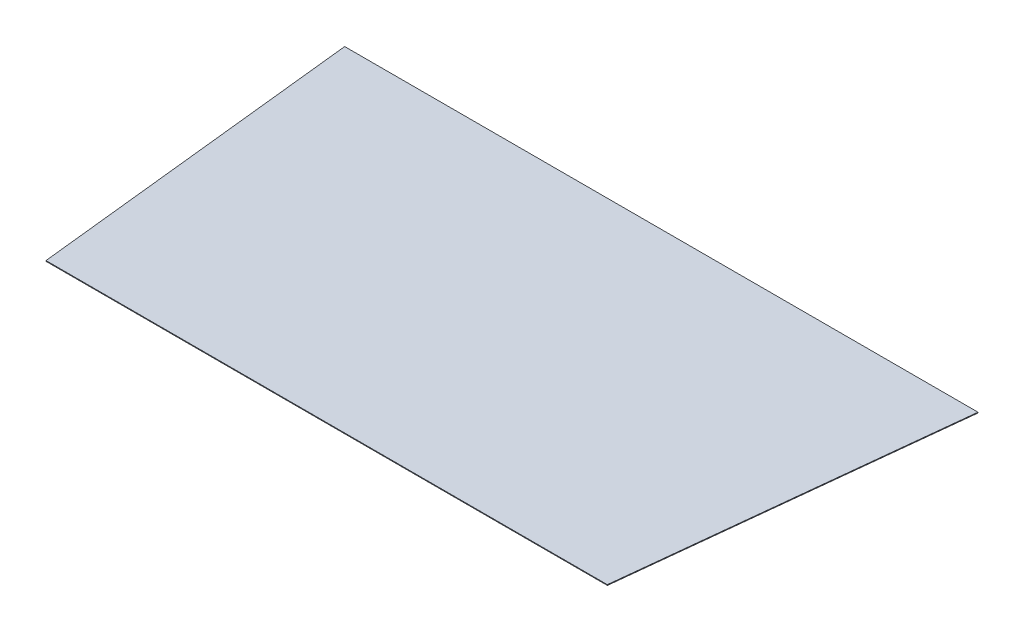
ISO-10303-21;
HEADER;
FILE_DESCRIPTION(('STEP AP214'),'2;1');
FILE_NAME('part.step','',(''),(''),'','','');
FILE_SCHEMA(('AUTOMOTIVE_DESIGN { 1 0 10303 214 1 1 1 1 }'));
ENDSEC;
DATA;
#1=APPLICATION_CONTEXT('core data for automotive mechanical design processes');
#2=APPLICATION_PROTOCOL_DEFINITION('international standard','automotive_design',2000,#1);
#3=PRODUCT_CONTEXT('',#1,'mechanical');
#4=PRODUCT('Part','Part','',(#3));
#5=PRODUCT_RELATED_PRODUCT_CATEGORY('part','',(#4));
#6=PRODUCT_DEFINITION_FORMATION('','',#4);
#7=PRODUCT_DEFINITION_CONTEXT('part definition',#1,'design');
#8=PRODUCT_DEFINITION('design','',#6,#7);
#9=PRODUCT_DEFINITION_SHAPE('','',#8);
#10=(LENGTH_UNIT() NAMED_UNIT(*) SI_UNIT(.MILLI.,.METRE.));
#11=(NAMED_UNIT(*) PLANE_ANGLE_UNIT() SI_UNIT($,.RADIAN.));
#12=(NAMED_UNIT(*) SI_UNIT($,.STERADIAN.) SOLID_ANGLE_UNIT());
#13=UNCERTAINTY_MEASURE_WITH_UNIT(LENGTH_MEASURE(1.E-05),#10,'distance_accuracy_value','');
#14=(GEOMETRIC_REPRESENTATION_CONTEXT(3) GLOBAL_UNCERTAINTY_ASSIGNED_CONTEXT((#13)) GLOBAL_UNIT_ASSIGNED_CONTEXT((#10,
#11,#12)) REPRESENTATION_CONTEXT('',''));
#15=CARTESIAN_POINT('',(0.,0.,0.));
#16=DIRECTION('',(0.,0.,1.));
#17=DIRECTION('',(1.,0.,0.));
#18=AXIS2_PLACEMENT_3D('',#15,#16,#17);
#19=CARTESIAN_POINT('',(-242.713203141225,1.,305.852560241163));
#20=DIRECTION('',(0.994268636888287,0.,-0.10691060611702));
#21=DIRECTION('',(-0.10691060611702,0.,-0.994268636888286));
#22=AXIS2_PLACEMENT_3D('',#19,#20,#21);
#23=PLANE('',#22);
#24=DIRECTION('',(0.10691060611702,0.,0.994268636888287));
#25=VECTOR('',#24,1.);
#26=CARTESIAN_POINT('',(-242.713203141225,0.,305.852560241163));
#27=LINE('',#26,#25);
#28=CARTESIAN_POINT('',(-292.713203141225,0.,-159.147439758837));
#29=VERTEX_POINT('',#28);
#30=CARTESIAN_POINT('',(-242.713203141225,0.,305.852560241163));
#31=VERTEX_POINT('',#30);
#32=EDGE_CURVE('E99',#29,#31,#27,.T.);
#33=ORIENTED_EDGE('',*,*,#32,.T.);
#34=DIRECTION('',(0.,-1.,0.));
#35=VECTOR('',#34,1.);
#36=CARTESIAN_POINT('',(-242.713203141225,1.,305.852560241163));
#37=LINE('',#36,#35);
#38=CARTESIAN_POINT('',(-242.713203141225,1.,305.852560241163));
#39=VERTEX_POINT('',#38);
#40=EDGE_CURVE('E11',#39,#31,#37,.T.);
#41=ORIENTED_EDGE('',*,*,#40,.F.);
#42=DIRECTION('',(0.10691060611702,0.,0.994268636888287));
#43=VECTOR('',#42,1.);
#44=CARTESIAN_POINT('',(-242.713203141225,1.,305.852560241163));
#45=LINE('',#44,#43);
#46=CARTESIAN_POINT('',(-292.713203141225,1.,-159.147439758837));
#47=VERTEX_POINT('',#46);
#48=EDGE_CURVE('E87',#47,#39,#45,.T.);
#49=ORIENTED_EDGE('',*,*,#48,.F.);
#50=DIRECTION('',(0.,-1.,0.));
#51=VECTOR('',#50,1.);
#52=CARTESIAN_POINT('',(-292.713203141225,1.,-159.147439758837));
#53=LINE('',#52,#51);
#54=EDGE_CURVE('E95',#47,#29,#53,.T.);
#55=ORIENTED_EDGE('',*,*,#54,.T.);
#56=EDGE_LOOP('',(#33,#41,#49,#55));
#57=FACE_BOUND('',#56,.T.);
#58=ADVANCED_FACE('F36',(#57),#23,.F.);
#59=CARTESIAN_POINT('',(-242.713203141225,1.,305.852560241163));
#60=DIRECTION('',(0.,0.,-1.));
#61=DIRECTION('',(-1.,0.,0.));
#62=AXIS2_PLACEMENT_3D('',#59,#60,#61);
#63=PLANE('',#62);
#64=DIRECTION('',(1.,0.,0.));
#65=VECTOR('',#64,1.);
#66=CARTESIAN_POINT('',(-242.713203141225,0.,305.852560241163));
#67=LINE('',#66,#65);
#68=CARTESIAN_POINT('',(537.286796858775,0.,305.852560241163));
#69=VERTEX_POINT('',#68);
#70=EDGE_CURVE('E91',#31,#69,#67,.T.);
#71=ORIENTED_EDGE('',*,*,#70,.T.);
#72=DIRECTION('',(0.,-1.,0.));
#73=VECTOR('',#72,1.);
#74=CARTESIAN_POINT('',(537.286796858775,1.,305.852560241163));
#75=LINE('',#74,#73);
#76=CARTESIAN_POINT('',(537.286796858775,1.,305.852560241163));
#77=VERTEX_POINT('',#76);
#78=EDGE_CURVE('E44',#77,#69,#75,.T.);
#79=ORIENTED_EDGE('',*,*,#78,.F.);
#80=DIRECTION('',(1.,0.,0.));
#81=VECTOR('',#80,1.);
#82=CARTESIAN_POINT('',(-242.713203141225,1.,305.852560241163));
#83=LINE('',#82,#81);
#84=EDGE_CURVE('E82',#39,#77,#83,.T.);
#85=ORIENTED_EDGE('',*,*,#84,.F.);
#86=ORIENTED_EDGE('',*,*,#40,.T.);
#87=EDGE_LOOP('',(#71,#79,#85,#86));
#88=FACE_BOUND('',#87,.T.);
#89=ADVANCED_FACE('F90',(#88),#63,.F.);
#90=CARTESIAN_POINT('',(587.286796858775,1.,-159.147439758837));
#91=DIRECTION('',(-0.994268636888286,0.,-0.10691060611702));
#92=DIRECTION('',(-0.10691060611702,0.,0.994268636888287));
#93=AXIS2_PLACEMENT_3D('',#90,#91,#92);
#94=PLANE('',#93);
#95=DIRECTION('',(0.10691060611702,0.,-0.994268636888287));
#96=VECTOR('',#95,1.);
#97=CARTESIAN_POINT('',(587.286796858775,0.,-159.147439758837));
#98=LINE('',#97,#96);
#99=CARTESIAN_POINT('',(587.286796858775,0.,-159.147439758837));
#100=VERTEX_POINT('',#99);
#101=EDGE_CURVE('E69',#69,#100,#98,.T.);
#102=ORIENTED_EDGE('',*,*,#101,.T.);
#103=DIRECTION('',(0.,-1.,0.));
#104=VECTOR('',#103,1.);
#105=CARTESIAN_POINT('',(587.286796858775,1.,-159.147439758837));
#106=LINE('',#105,#104);
#107=CARTESIAN_POINT('',(587.286796858775,1.,-159.147439758837));
#108=VERTEX_POINT('',#107);
#109=EDGE_CURVE('E92',#108,#100,#106,.T.);
#110=ORIENTED_EDGE('',*,*,#109,.F.);
#111=DIRECTION('',(0.10691060611702,0.,-0.994268636888287));
#112=VECTOR('',#111,1.);
#113=CARTESIAN_POINT('',(587.286796858775,1.,-159.147439758837));
#114=LINE('',#113,#112);
#115=EDGE_CURVE('E85',#77,#108,#114,.T.);
#116=ORIENTED_EDGE('',*,*,#115,.F.);
#117=ORIENTED_EDGE('',*,*,#78,.T.);
#118=EDGE_LOOP('',(#102,#110,#116,#117));
#119=FACE_BOUND('',#118,.T.);
#120=ADVANCED_FACE('F93',(#119),#94,.F.);
#121=CARTESIAN_POINT('',(-292.713203141225,1.,-159.147439758837));
#122=DIRECTION('',(0.,0.,1.));
#123=DIRECTION('',(1.,0.,0.));
#124=AXIS2_PLACEMENT_3D('',#121,#122,#123);
#125=PLANE('',#124);
#126=DIRECTION('',(-1.,0.,0.));
#127=VECTOR('',#126,1.);
#128=CARTESIAN_POINT('',(-292.713203141225,0.,-159.147439758837));
#129=LINE('',#128,#127);
#130=EDGE_CURVE('E75',#100,#29,#129,.T.);
#131=ORIENTED_EDGE('',*,*,#130,.T.);
#132=ORIENTED_EDGE('',*,*,#54,.F.);
#133=DIRECTION('',(-1.,0.,0.));
#134=VECTOR('',#133,1.);
#135=CARTESIAN_POINT('',(-292.713203141225,1.,-159.147439758837));
#136=LINE('',#135,#134);
#137=EDGE_CURVE('E52',#108,#47,#136,.T.);
#138=ORIENTED_EDGE('',*,*,#137,.F.);
#139=ORIENTED_EDGE('',*,*,#109,.T.);
#140=EDGE_LOOP('',(#131,#132,#138,#139));
#141=FACE_BOUND('',#140,.T.);
#142=ADVANCED_FACE('F106',(#141),#125,.F.);
#143=CARTESIAN_POINT('',(0.,1.,0.));
#144=DIRECTION('',(0.,-1.,0.));
#145=DIRECTION('',(0.,0.,-1.));
#146=AXIS2_PLACEMENT_3D('',#143,#144,#145);
#147=PLANE('',#146);
#148=ORIENTED_EDGE('',*,*,#48,.T.);
#149=ORIENTED_EDGE('',*,*,#84,.T.);
#150=ORIENTED_EDGE('',*,*,#115,.T.);
#151=ORIENTED_EDGE('',*,*,#137,.T.);
#152=EDGE_LOOP('',(#148,#149,#150,#151));
#153=FACE_BOUND('',#152,.T.);
#154=ADVANCED_FACE('F83',(#153),#147,.F.);
#155=CARTESIAN_POINT('',(0.,0.,0.));
#156=DIRECTION('',(0.,-1.,0.));
#157=DIRECTION('',(0.,0.,-1.));
#158=AXIS2_PLACEMENT_3D('',#155,#156,#157);
#159=PLANE('',#158);
#160=ORIENTED_EDGE('',*,*,#32,.F.);
#161=ORIENTED_EDGE('',*,*,#130,.F.);
#162=ORIENTED_EDGE('',*,*,#101,.F.);
#163=ORIENTED_EDGE('',*,*,#70,.F.);
#164=EDGE_LOOP('',(#160,#161,#162,#163));
#165=FACE_BOUND('',#164,.T.);
#166=ADVANCED_FACE('F109',(#165),#159,.T.);
#167=CLOSED_SHELL('',(#58,#89,#120,#142,#154,#166));
#168=MANIFOLD_SOLID_BREP('B2',#167);
#169=ADVANCED_BREP_SHAPE_REPRESENTATION('',(#18,#168),#14);
#170=SHAPE_DEFINITION_REPRESENTATION(#9,#169);
ENDSEC;
END-ISO-10303-21;
